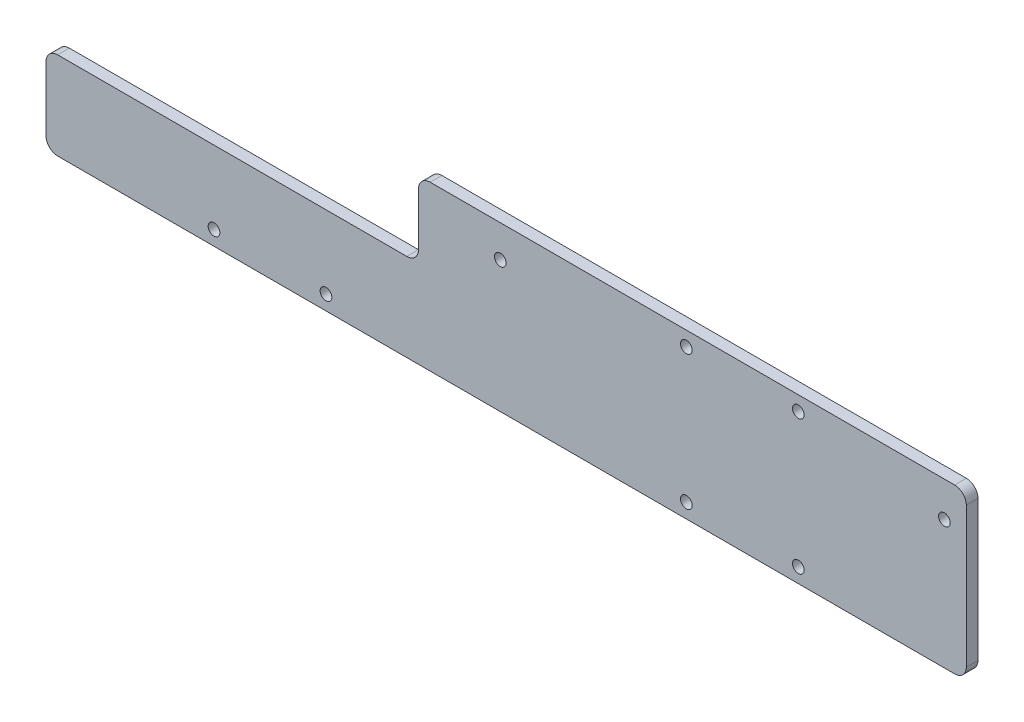
ISO-10303-21;
HEADER;
FILE_DESCRIPTION(('STEP AP214'),'2;1');
FILE_NAME('part.step','',(''),(''),'','','');
FILE_SCHEMA(('AUTOMOTIVE_DESIGN { 1 0 10303 214 1 1 1 1 }'));
ENDSEC;
DATA;
#1=APPLICATION_CONTEXT('core data for automotive mechanical design processes');
#2=APPLICATION_PROTOCOL_DEFINITION('international standard','automotive_design',2000,#1);
#3=PRODUCT_CONTEXT('',#1,'mechanical');
#4=PRODUCT('Part','Part','',(#3));
#5=PRODUCT_RELATED_PRODUCT_CATEGORY('part','',(#4));
#6=PRODUCT_DEFINITION_FORMATION('','',#4);
#7=PRODUCT_DEFINITION_CONTEXT('part definition',#1,'design');
#8=PRODUCT_DEFINITION('design','',#6,#7);
#9=PRODUCT_DEFINITION_SHAPE('','',#8);
#10=(LENGTH_UNIT() NAMED_UNIT(*) SI_UNIT(.MILLI.,.METRE.));
#11=(NAMED_UNIT(*) PLANE_ANGLE_UNIT() SI_UNIT($,.RADIAN.));
#12=(NAMED_UNIT(*) SI_UNIT($,.STERADIAN.) SOLID_ANGLE_UNIT());
#13=UNCERTAINTY_MEASURE_WITH_UNIT(LENGTH_MEASURE(1.E-05),#10,'distance_accuracy_value','');
#14=(GEOMETRIC_REPRESENTATION_CONTEXT(3) GLOBAL_UNCERTAINTY_ASSIGNED_CONTEXT((#13)) GLOBAL_UNIT_ASSIGNED_CONTEXT((#10,
#11,#12)) REPRESENTATION_CONTEXT('',''));
#15=CARTESIAN_POINT('',(0.,0.,0.));
#16=DIRECTION('',(0.,0.,1.));
#17=DIRECTION('',(1.,0.,0.));
#18=AXIS2_PLACEMENT_3D('',#15,#16,#17);
#19=CARTESIAN_POINT('',(0.,17.5899107385243,4.));
#20=DIRECTION('',(0.,-1.,0.));
#21=DIRECTION('',(1.,0.,0.));
#22=AXIS2_PLACEMENT_3D('',#19,#20,#21);
#23=PLANE('',#22);
#24=DIRECTION('',(0.,0.,-1.));
#25=VECTOR('',#24,1.);
#26=CARTESIAN_POINT('',(-61.1940627545055,17.5899107385243,4.));
#27=LINE('',#26,#25);
#28=CARTESIAN_POINT('',(-61.1940627545055,17.5899107385243,4.));
#29=VERTEX_POINT('',#28);
#30=CARTESIAN_POINT('',(-61.1940627545055,17.5899107385243,0.));
#31=VERTEX_POINT('',#30);
#32=EDGE_CURVE('E329',#29,#31,#27,.T.);
#33=ORIENTED_EDGE('',*,*,#32,.T.);
#34=DIRECTION('',(-1.,0.,0.));
#35=VECTOR('',#34,1.);
#36=CARTESIAN_POINT('',(0.,17.5899107385243,0.));
#37=LINE('',#36,#35);
#38=CARTESIAN_POINT('',(-180.694062754505,17.5899107385243,0.));
#39=VERTEX_POINT('',#38);
#40=EDGE_CURVE('E184',#31,#39,#37,.T.);
#41=ORIENTED_EDGE('',*,*,#40,.T.);
#42=DIRECTION('',(0.,0.,-1.));
#43=VECTOR('',#42,1.);
#44=CARTESIAN_POINT('',(-180.694062754505,17.5899107385243,4.));
#45=LINE('',#44,#43);
#46=CARTESIAN_POINT('',(-180.694062754505,17.5899107385243,4.));
#47=VERTEX_POINT('',#46);
#48=EDGE_CURVE('E11',#47,#39,#45,.T.);
#49=ORIENTED_EDGE('',*,*,#48,.F.);
#50=DIRECTION('',(-1.,0.,0.));
#51=VECTOR('',#50,1.);
#52=CARTESIAN_POINT('',(0.,17.5899107385243,4.));
#53=LINE('',#52,#51);
#54=EDGE_CURVE('E56',#29,#47,#53,.T.);
#55=ORIENTED_EDGE('',*,*,#54,.F.);
#56=EDGE_LOOP('',(#33,#41,#49,#55));
#57=FACE_BOUND('',#56,.T.);
#58=ADVANCED_FACE('F41',(#57),#23,.F.);
#59=CARTESIAN_POINT('',(-180.694062754505,13.5899107385243,4.));
#60=DIRECTION('',(0.,0.,-1.));
#61=DIRECTION('',(-1.,0.,0.));
#62=AXIS2_PLACEMENT_3D('',#59,#60,#61);
#63=CYLINDRICAL_SURFACE('',#62,4.);
#64=CARTESIAN_POINT('',(-180.694062754505,13.5899107385243,0.));
#65=DIRECTION('',(0.,0.,1.));
#66=DIRECTION('',(1.,0.,0.));
#67=AXIS2_PLACEMENT_3D('',#64,#65,#66);
#68=CIRCLE('',#67,4.);
#69=CARTESIAN_POINT('',(-184.694062754505,13.5899107385243,0.));
#70=VERTEX_POINT('',#69);
#71=EDGE_CURVE('E187',#70,#39,#68,.F.);
#72=ORIENTED_EDGE('',*,*,#71,.F.);
#73=DIRECTION('',(0.,0.,-1.));
#74=VECTOR('',#73,1.);
#75=CARTESIAN_POINT('',(-184.694062754505,13.5899107385243,4.));
#76=LINE('',#75,#74);
#77=CARTESIAN_POINT('',(-184.694062754505,13.5899107385243,4.));
#78=VERTEX_POINT('',#77);
#79=EDGE_CURVE('E49',#78,#70,#76,.T.);
#80=ORIENTED_EDGE('',*,*,#79,.F.);
#81=CARTESIAN_POINT('',(-180.694062754505,13.5899107385243,4.));
#82=DIRECTION('',(0.,0.,1.));
#83=DIRECTION('',(1.,0.,0.));
#84=AXIS2_PLACEMENT_3D('',#81,#82,#83);
#85=CIRCLE('',#84,4.);
#86=EDGE_CURVE('E277',#78,#47,#85,.F.);
#87=ORIENTED_EDGE('',*,*,#86,.T.);
#88=ORIENTED_EDGE('',*,*,#48,.T.);
#89=EDGE_LOOP('',(#72,#80,#87,#88));
#90=FACE_BOUND('',#89,.T.);
#91=ADVANCED_FACE('F265',(#90),#63,.T.);
#92=CARTESIAN_POINT('',(-184.694062754505,0.,4.));
#93=DIRECTION('',(-1.,0.,0.));
#94=DIRECTION('',(0.,0.,1.));
#95=AXIS2_PLACEMENT_3D('',#92,#93,#94);
#96=PLANE('',#95);
#97=DIRECTION('',(0.,1.,0.));
#98=VECTOR('',#97,1.);
#99=CARTESIAN_POINT('',(-184.694062754505,0.,0.));
#100=LINE('',#99,#98);
#101=CARTESIAN_POINT('',(-184.694062754505,-8.41008926147568,0.));
#102=VERTEX_POINT('',#101);
#103=EDGE_CURVE('E192',#102,#70,#100,.T.);
#104=ORIENTED_EDGE('',*,*,#103,.F.);
#105=DIRECTION('',(0.,0.,-1.));
#106=VECTOR('',#105,1.);
#107=CARTESIAN_POINT('',(-184.694062754505,-8.41008926147568,4.));
#108=LINE('',#107,#106);
#109=CARTESIAN_POINT('',(-184.694062754505,-8.41008926147568,4.));
#110=VERTEX_POINT('',#109);
#111=EDGE_CURVE('E253',#110,#102,#108,.T.);
#112=ORIENTED_EDGE('',*,*,#111,.F.);
#113=DIRECTION('',(0.,1.,0.));
#114=VECTOR('',#113,1.);
#115=CARTESIAN_POINT('',(-184.694062754505,0.,4.));
#116=LINE('',#115,#114);
#117=EDGE_CURVE('E262',#110,#78,#116,.T.);
#118=ORIENTED_EDGE('',*,*,#117,.T.);
#119=ORIENTED_EDGE('',*,*,#79,.T.);
#120=EDGE_LOOP('',(#104,#112,#118,#119));
#121=FACE_BOUND('',#120,.T.);
#122=ADVANCED_FACE('F260',(#121),#96,.T.);
#123=CARTESIAN_POINT('',(-180.694062754505,-8.41008926147568,4.));
#124=DIRECTION('',(0.,0.,-1.));
#125=DIRECTION('',(-1.,0.,0.));
#126=AXIS2_PLACEMENT_3D('',#123,#124,#125);
#127=CYLINDRICAL_SURFACE('',#126,4.);
#128=CARTESIAN_POINT('',(-180.694062754505,-8.41008926147568,0.));
#129=DIRECTION('',(0.,0.,1.));
#130=DIRECTION('',(1.,0.,0.));
#131=AXIS2_PLACEMENT_3D('',#128,#129,#130);
#132=CIRCLE('',#131,4.);
#133=CARTESIAN_POINT('',(-180.694062754505,-12.4100892614757,0.));
#134=VERTEX_POINT('',#133);
#135=EDGE_CURVE('E196',#134,#102,#132,.F.);
#136=ORIENTED_EDGE('',*,*,#135,.F.);
#137=DIRECTION('',(0.,0.,-1.));
#138=VECTOR('',#137,1.);
#139=CARTESIAN_POINT('',(-180.694062754505,-12.4100892614757,4.));
#140=LINE('',#139,#138);
#141=CARTESIAN_POINT('',(-180.694062754505,-12.4100892614757,4.));
#142=VERTEX_POINT('',#141);
#143=EDGE_CURVE('E250',#142,#134,#140,.T.);
#144=ORIENTED_EDGE('',*,*,#143,.F.);
#145=CARTESIAN_POINT('',(-180.694062754505,-8.41008926147568,4.));
#146=DIRECTION('',(0.,0.,1.));
#147=DIRECTION('',(1.,0.,0.));
#148=AXIS2_PLACEMENT_3D('',#145,#146,#147);
#149=CIRCLE('',#148,4.);
#150=EDGE_CURVE('E276',#142,#110,#149,.F.);
#151=ORIENTED_EDGE('',*,*,#150,.T.);
#152=ORIENTED_EDGE('',*,*,#111,.T.);
#153=EDGE_LOOP('',(#136,#144,#151,#152));
#154=FACE_BOUND('',#153,.T.);
#155=ADVANCED_FACE('F274',(#154),#127,.T.);
#156=CARTESIAN_POINT('',(0.,-12.4100892614757,4.));
#157=DIRECTION('',(0.,-1.,0.));
#158=DIRECTION('',(1.,0.,0.));
#159=AXIS2_PLACEMENT_3D('',#156,#157,#158);
#160=PLANE('',#159);
#161=DIRECTION('',(-1.,0.,0.));
#162=VECTOR('',#161,1.);
#163=CARTESIAN_POINT('',(0.,-12.4100892614757,0.));
#164=LINE('',#163,#162);
#165=CARTESIAN_POINT('',(126.305937245495,-12.4100892614757,0.));
#166=VERTEX_POINT('',#165);
#167=EDGE_CURVE('E200',#166,#134,#164,.T.);
#168=ORIENTED_EDGE('',*,*,#167,.F.);
#169=DIRECTION('',(0.,0.,-1.));
#170=VECTOR('',#169,1.);
#171=CARTESIAN_POINT('',(126.305937245495,-12.4100892614757,4.));
#172=LINE('',#171,#170);
#173=CARTESIAN_POINT('',(126.305937245495,-12.4100892614757,4.));
#174=VERTEX_POINT('',#173);
#175=EDGE_CURVE('E142',#174,#166,#172,.T.);
#176=ORIENTED_EDGE('',*,*,#175,.F.);
#177=DIRECTION('',(-1.,0.,0.));
#178=VECTOR('',#177,1.);
#179=CARTESIAN_POINT('',(0.,-12.4100892614757,4.));
#180=LINE('',#179,#178);
#181=EDGE_CURVE('E130',#174,#142,#180,.T.);
#182=ORIENTED_EDGE('',*,*,#181,.T.);
#183=ORIENTED_EDGE('',*,*,#143,.T.);
#184=EDGE_LOOP('',(#168,#176,#182,#183));
#185=FACE_BOUND('',#184,.T.);
#186=ADVANCED_FACE('F287',(#185),#160,.T.);
#187=CARTESIAN_POINT('',(126.305937245495,-8.41008926147565,4.));
#188=DIRECTION('',(0.,0.,-1.));
#189=DIRECTION('',(-1.,0.,0.));
#190=AXIS2_PLACEMENT_3D('',#187,#188,#189);
#191=CYLINDRICAL_SURFACE('',#190,4.);
#192=CARTESIAN_POINT('',(126.305937245495,-8.41008926147565,0.));
#193=DIRECTION('',(0.,0.,1.));
#194=DIRECTION('',(1.,0.,0.));
#195=AXIS2_PLACEMENT_3D('',#192,#193,#194);
#196=CIRCLE('',#195,4.);
#197=CARTESIAN_POINT('',(130.305937245495,-8.41008926147565,0.));
#198=VERTEX_POINT('',#197);
#199=EDGE_CURVE('E138',#166,#198,#196,.T.);
#200=ORIENTED_EDGE('',*,*,#199,.T.);
#201=DIRECTION('',(0.,0.,-1.));
#202=VECTOR('',#201,1.);
#203=CARTESIAN_POINT('',(130.305937245495,-8.41008926147565,4.));
#204=LINE('',#203,#202);
#205=CARTESIAN_POINT('',(130.305937245495,-8.41008926147565,4.));
#206=VERTEX_POINT('',#205);
#207=EDGE_CURVE('E135',#206,#198,#204,.T.);
#208=ORIENTED_EDGE('',*,*,#207,.F.);
#209=CARTESIAN_POINT('',(126.305937245495,-8.41008926147565,4.));
#210=DIRECTION('',(0.,0.,1.));
#211=DIRECTION('',(1.,0.,0.));
#212=AXIS2_PLACEMENT_3D('',#209,#210,#211);
#213=CIRCLE('',#212,4.);
#214=EDGE_CURVE('E121',#174,#206,#213,.T.);
#215=ORIENTED_EDGE('',*,*,#214,.F.);
#216=ORIENTED_EDGE('',*,*,#175,.T.);
#217=EDGE_LOOP('',(#200,#208,#215,#216));
#218=FACE_BOUND('',#217,.T.);
#219=ADVANCED_FACE('F136',(#218),#191,.T.);
#220=CARTESIAN_POINT('',(130.305937245495,0.,4.));
#221=DIRECTION('',(-1.,0.,0.));
#222=DIRECTION('',(0.,0.,1.));
#223=AXIS2_PLACEMENT_3D('',#220,#221,#222);
#224=PLANE('',#223);
#225=DIRECTION('',(0.,1.,0.));
#226=VECTOR('',#225,1.);
#227=CARTESIAN_POINT('',(130.305937245495,0.,0.));
#228=LINE('',#227,#226);
#229=CARTESIAN_POINT('',(130.305937245495,39.5899107385243,0.));
#230=VERTEX_POINT('',#229);
#231=EDGE_CURVE('E206',#198,#230,#228,.T.);
#232=ORIENTED_EDGE('',*,*,#231,.T.);
#233=DIRECTION('',(0.,0.,-1.));
#234=VECTOR('',#233,1.);
#235=CARTESIAN_POINT('',(130.305937245495,39.5899107385243,4.));
#236=LINE('',#235,#234);
#237=CARTESIAN_POINT('',(130.305937245495,39.5899107385243,4.));
#238=VERTEX_POINT('',#237);
#239=EDGE_CURVE('E143',#238,#230,#236,.T.);
#240=ORIENTED_EDGE('',*,*,#239,.F.);
#241=DIRECTION('',(0.,1.,0.));
#242=VECTOR('',#241,1.);
#243=CARTESIAN_POINT('',(130.305937245495,0.,4.));
#244=LINE('',#243,#242);
#245=EDGE_CURVE('E126',#206,#238,#244,.T.);
#246=ORIENTED_EDGE('',*,*,#245,.F.);
#247=ORIENTED_EDGE('',*,*,#207,.T.);
#248=EDGE_LOOP('',(#232,#240,#246,#247));
#249=FACE_BOUND('',#248,.T.);
#250=ADVANCED_FACE('F145',(#249),#224,.F.);
#251=CARTESIAN_POINT('',(126.305937245495,39.5899107385243,4.));
#252=DIRECTION('',(0.,0.,-1.));
#253=DIRECTION('',(-1.,0.,0.));
#254=AXIS2_PLACEMENT_3D('',#251,#252,#253);
#255=CYLINDRICAL_SURFACE('',#254,4.);
#256=CARTESIAN_POINT('',(126.305937245495,39.5899107385243,0.));
#257=DIRECTION('',(0.,0.,1.));
#258=DIRECTION('',(1.,0.,0.));
#259=AXIS2_PLACEMENT_3D('',#256,#257,#258);
#260=CIRCLE('',#259,4.);
#261=CARTESIAN_POINT('',(126.305937245495,43.5899107385243,0.));
#262=VERTEX_POINT('',#261);
#263=EDGE_CURVE('E209',#230,#262,#260,.T.);
#264=ORIENTED_EDGE('',*,*,#263,.T.);
#265=DIRECTION('',(0.,0.,-1.));
#266=VECTOR('',#265,1.);
#267=CARTESIAN_POINT('',(126.305937245495,43.5899107385243,4.));
#268=LINE('',#267,#266);
#269=CARTESIAN_POINT('',(126.305937245495,43.5899107385243,4.));
#270=VERTEX_POINT('',#269);
#271=EDGE_CURVE('E98',#270,#262,#268,.T.);
#272=ORIENTED_EDGE('',*,*,#271,.F.);
#273=CARTESIAN_POINT('',(126.305937245495,39.5899107385243,4.));
#274=DIRECTION('',(0.,0.,1.));
#275=DIRECTION('',(1.,0.,0.));
#276=AXIS2_PLACEMENT_3D('',#273,#274,#275);
#277=CIRCLE('',#276,4.);
#278=EDGE_CURVE('E65',#238,#270,#277,.T.);
#279=ORIENTED_EDGE('',*,*,#278,.F.);
#280=ORIENTED_EDGE('',*,*,#239,.T.);
#281=EDGE_LOOP('',(#264,#272,#279,#280));
#282=FACE_BOUND('',#281,.T.);
#283=ADVANCED_FACE('F290',(#282),#255,.T.);
#284=CARTESIAN_POINT('',(0.,43.5899107385243,4.));
#285=DIRECTION('',(0.,1.,0.));
#286=DIRECTION('',(-1.,0.,0.));
#287=AXIS2_PLACEMENT_3D('',#284,#285,#286);
#288=PLANE('',#287);
#289=DIRECTION('',(1.,0.,0.));
#290=VECTOR('',#289,1.);
#291=CARTESIAN_POINT('',(0.,43.5899107385243,0.));
#292=LINE('',#291,#290);
#293=CARTESIAN_POINT('',(-53.1940627545055,43.5899107385243,0.));
#294=VERTEX_POINT('',#293);
#295=EDGE_CURVE('E212',#294,#262,#292,.T.);
#296=ORIENTED_EDGE('',*,*,#295,.F.);
#297=DIRECTION('',(0.,0.,-1.));
#298=VECTOR('',#297,1.);
#299=CARTESIAN_POINT('',(-53.1940627545055,43.5899107385243,4.));
#300=LINE('',#299,#298);
#301=CARTESIAN_POINT('',(-53.1940627545055,43.5899107385243,4.));
#302=VERTEX_POINT('',#301);
#303=EDGE_CURVE('E188',#302,#294,#300,.T.);
#304=ORIENTED_EDGE('',*,*,#303,.F.);
#305=DIRECTION('',(1.,0.,0.));
#306=VECTOR('',#305,1.);
#307=CARTESIAN_POINT('',(0.,43.5899107385243,4.));
#308=LINE('',#307,#306);
#309=EDGE_CURVE('E150',#302,#270,#308,.T.);
#310=ORIENTED_EDGE('',*,*,#309,.T.);
#311=ORIENTED_EDGE('',*,*,#271,.T.);
#312=EDGE_LOOP('',(#296,#304,#310,#311));
#313=FACE_BOUND('',#312,.T.);
#314=ADVANCED_FACE('F292',(#313),#288,.T.);
#315=CARTESIAN_POINT('',(-127.194062754505,-7.41008926147568,4.));
#316=DIRECTION('',(0.,0.,-1.));
#317=DIRECTION('',(-1.,0.,0.));
#318=AXIS2_PLACEMENT_3D('',#315,#316,#317);
#319=CYLINDRICAL_SURFACE('',#318,2.);
#320=CARTESIAN_POINT('',(-127.194062754505,-7.41008926147568,4.));
#321=DIRECTION('',(0.,0.,1.));
#322=DIRECTION('',(1.,0.,0.));
#323=AXIS2_PLACEMENT_3D('',#320,#321,#322);
#324=CIRCLE('',#323,2.);
#325=CARTESIAN_POINT('',(-125.194062754505,-7.41008926147568,4.));
#326=VERTEX_POINT('',#325);
#327=EDGE_CURVE('E176',#326,#326,#324,.T.);
#328=ORIENTED_EDGE('',*,*,#327,.T.);
#329=EDGE_LOOP('',(#328));
#330=FACE_BOUND('',#329,.T.);
#331=CARTESIAN_POINT('',(-127.194062754505,-7.41008926147568,0.));
#332=DIRECTION('',(0.,0.,1.));
#333=DIRECTION('',(1.,0.,0.));
#334=AXIS2_PLACEMENT_3D('',#331,#332,#333);
#335=CIRCLE('',#334,2.);
#336=CARTESIAN_POINT('',(-125.194062754505,-7.41008926147568,0.));
#337=VERTEX_POINT('',#336);
#338=EDGE_CURVE('E236',#337,#337,#335,.T.);
#339=ORIENTED_EDGE('',*,*,#338,.F.);
#340=EDGE_LOOP('',(#339));
#341=FACE_BOUND('',#340,.T.);
#342=ADVANCED_FACE('F388',(#330,#341),#319,.F.);
#343=CARTESIAN_POINT('',(-88.8640627545055,-7.41008926147558,4.));
#344=DIRECTION('',(0.,0.,-1.));
#345=DIRECTION('',(-1.,0.,0.));
#346=AXIS2_PLACEMENT_3D('',#343,#344,#345);
#347=CYLINDRICAL_SURFACE('',#346,2.);
#348=CARTESIAN_POINT('',(-88.8640627545055,-7.41008926147558,4.));
#349=DIRECTION('',(0.,0.,1.));
#350=DIRECTION('',(1.,0.,0.));
#351=AXIS2_PLACEMENT_3D('',#348,#349,#350);
#352=CIRCLE('',#351,2.);
#353=CARTESIAN_POINT('',(-86.8640627545055,-7.41008926147558,4.));
#354=VERTEX_POINT('',#353);
#355=EDGE_CURVE('E172',#354,#354,#352,.T.);
#356=ORIENTED_EDGE('',*,*,#355,.T.);
#357=EDGE_LOOP('',(#356));
#358=FACE_BOUND('',#357,.T.);
#359=CARTESIAN_POINT('',(-88.8640627545055,-7.41008926147558,0.));
#360=DIRECTION('',(0.,0.,1.));
#361=DIRECTION('',(1.,0.,0.));
#362=AXIS2_PLACEMENT_3D('',#359,#360,#361);
#363=CIRCLE('',#362,2.);
#364=CARTESIAN_POINT('',(-86.8640627545055,-7.41008926147558,0.));
#365=VERTEX_POINT('',#364);
#366=EDGE_CURVE('E232',#365,#365,#363,.T.);
#367=ORIENTED_EDGE('',*,*,#366,.F.);
#368=EDGE_LOOP('',(#367));
#369=FACE_BOUND('',#368,.T.);
#370=ADVANCED_FACE('F405',(#358,#369),#347,.F.);
#371=CARTESIAN_POINT('',(34.4759372454946,-7.41008926147557,4.));
#372=DIRECTION('',(0.,0.,-1.));
#373=DIRECTION('',(-1.,0.,0.));
#374=AXIS2_PLACEMENT_3D('',#371,#372,#373);
#375=CYLINDRICAL_SURFACE('',#374,2.);
#376=CARTESIAN_POINT('',(34.4759372454946,-7.41008926147557,4.));
#377=DIRECTION('',(0.,0.,1.));
#378=DIRECTION('',(1.,0.,0.));
#379=AXIS2_PLACEMENT_3D('',#376,#377,#378);
#380=CIRCLE('',#379,2.);
#381=CARTESIAN_POINT('',(36.4759372454946,-7.41008926147557,4.));
#382=VERTEX_POINT('',#381);
#383=EDGE_CURVE('E168',#382,#382,#380,.F.);
#384=ORIENTED_EDGE('',*,*,#383,.F.);
#385=EDGE_LOOP('',(#384));
#386=FACE_BOUND('',#385,.T.);
#387=CARTESIAN_POINT('',(34.4759372454946,-7.41008926147557,0.));
#388=DIRECTION('',(0.,0.,1.));
#389=DIRECTION('',(1.,0.,0.));
#390=AXIS2_PLACEMENT_3D('',#387,#388,#389);
#391=CIRCLE('',#390,2.);
#392=CARTESIAN_POINT('',(36.4759372454946,-7.41008926147557,0.));
#393=VERTEX_POINT('',#392);
#394=EDGE_CURVE('E228',#393,#393,#391,.F.);
#395=ORIENTED_EDGE('',*,*,#394,.T.);
#396=EDGE_LOOP('',(#395));
#397=FACE_BOUND('',#396,.T.);
#398=ADVANCED_FACE('F401',(#386,#397),#375,.F.);
#399=CARTESIAN_POINT('',(34.4759372454945,38.5899107385244,4.));
#400=DIRECTION('',(0.,0.,-1.));
#401=DIRECTION('',(-1.,0.,0.));
#402=AXIS2_PLACEMENT_3D('',#399,#400,#401);
#403=CYLINDRICAL_SURFACE('',#402,1.99999999999999);
#404=CARTESIAN_POINT('',(34.4759372454945,38.5899107385244,4.));
#405=DIRECTION('',(0.,0.,1.));
#406=DIRECTION('',(1.,0.,0.));
#407=AXIS2_PLACEMENT_3D('',#404,#405,#406);
#408=CIRCLE('',#407,1.99999999999999);
#409=CARTESIAN_POINT('',(36.4759372454945,38.5899107385244,4.));
#410=VERTEX_POINT('',#409);
#411=EDGE_CURVE('E164',#410,#410,#408,.T.);
#412=ORIENTED_EDGE('',*,*,#411,.T.);
#413=EDGE_LOOP('',(#412));
#414=FACE_BOUND('',#413,.T.);
#415=CARTESIAN_POINT('',(34.4759372454945,38.5899107385244,0.));
#416=DIRECTION('',(0.,0.,1.));
#417=DIRECTION('',(1.,0.,0.));
#418=AXIS2_PLACEMENT_3D('',#415,#416,#417);
#419=CIRCLE('',#418,1.99999999999999);
#420=CARTESIAN_POINT('',(36.4759372454945,38.5899107385244,0.));
#421=VERTEX_POINT('',#420);
#422=EDGE_CURVE('E224',#421,#421,#419,.T.);
#423=ORIENTED_EDGE('',*,*,#422,.F.);
#424=EDGE_LOOP('',(#423));
#425=FACE_BOUND('',#424,.T.);
#426=ADVANCED_FACE('F397',(#414,#425),#403,.F.);
#427=CARTESIAN_POINT('',(72.8059372454945,38.5899107385243,4.));
#428=DIRECTION('',(0.,0.,-1.));
#429=DIRECTION('',(-1.,0.,0.));
#430=AXIS2_PLACEMENT_3D('',#427,#428,#429);
#431=CYLINDRICAL_SURFACE('',#430,2.);
#432=CARTESIAN_POINT('',(72.8059372454945,38.5899107385243,4.));
#433=DIRECTION('',(0.,0.,1.));
#434=DIRECTION('',(1.,0.,0.));
#435=AXIS2_PLACEMENT_3D('',#432,#433,#434);
#436=CIRCLE('',#435,2.);
#437=CARTESIAN_POINT('',(74.8059372454945,38.5899107385243,4.));
#438=VERTEX_POINT('',#437);
#439=EDGE_CURVE('E160',#438,#438,#436,.T.);
#440=ORIENTED_EDGE('',*,*,#439,.T.);
#441=EDGE_LOOP('',(#440));
#442=FACE_BOUND('',#441,.T.);
#443=CARTESIAN_POINT('',(72.8059372454945,38.5899107385243,0.));
#444=DIRECTION('',(0.,0.,1.));
#445=DIRECTION('',(1.,0.,0.));
#446=AXIS2_PLACEMENT_3D('',#443,#444,#445);
#447=CIRCLE('',#446,2.);
#448=CARTESIAN_POINT('',(74.8059372454945,38.5899107385243,0.));
#449=VERTEX_POINT('',#448);
#450=EDGE_CURVE('E220',#449,#449,#447,.T.);
#451=ORIENTED_EDGE('',*,*,#450,.F.);
#452=EDGE_LOOP('',(#451));
#453=FACE_BOUND('',#452,.T.);
#454=ADVANCED_FACE('F393',(#442,#453),#431,.F.);
#455=CARTESIAN_POINT('',(122.805937245495,31.5899107385243,4.));
#456=DIRECTION('',(0.,0.,-1.));
#457=DIRECTION('',(-1.,0.,0.));
#458=AXIS2_PLACEMENT_3D('',#455,#456,#457);
#459=CYLINDRICAL_SURFACE('',#458,2.);
#460=CARTESIAN_POINT('',(122.805937245495,31.5899107385243,4.));
#461=DIRECTION('',(0.,0.,1.));
#462=DIRECTION('',(1.,0.,0.));
#463=AXIS2_PLACEMENT_3D('',#460,#461,#462);
#464=CIRCLE('',#463,2.);
#465=CARTESIAN_POINT('',(124.805937245495,31.5899107385243,4.));
#466=VERTEX_POINT('',#465);
#467=EDGE_CURVE('E156',#466,#466,#464,.T.);
#468=ORIENTED_EDGE('',*,*,#467,.T.);
#469=EDGE_LOOP('',(#468));
#470=FACE_BOUND('',#469,.T.);
#471=CARTESIAN_POINT('',(122.805937245495,31.5899107385243,0.));
#472=DIRECTION('',(0.,0.,1.));
#473=DIRECTION('',(1.,0.,0.));
#474=AXIS2_PLACEMENT_3D('',#471,#472,#473);
#475=CIRCLE('',#474,2.);
#476=CARTESIAN_POINT('',(124.805937245495,31.5899107385243,0.));
#477=VERTEX_POINT('',#476);
#478=EDGE_CURVE('E216',#477,#477,#475,.T.);
#479=ORIENTED_EDGE('',*,*,#478,.F.);
#480=EDGE_LOOP('',(#479));
#481=FACE_BOUND('',#480,.T.);
#482=ADVANCED_FACE('F389',(#470,#481),#459,.F.);
#483=CARTESIAN_POINT('',(72.8059372454946,-7.41008926147566,4.));
#484=DIRECTION('',(0.,0.,-1.));
#485=DIRECTION('',(-1.,0.,0.));
#486=AXIS2_PLACEMENT_3D('',#483,#484,#485);
#487=CYLINDRICAL_SURFACE('',#486,2.00000000000001);
#488=CARTESIAN_POINT('',(72.8059372454946,-7.41008926147566,4.));
#489=DIRECTION('',(0.,0.,1.));
#490=DIRECTION('',(1.,0.,0.));
#491=AXIS2_PLACEMENT_3D('',#488,#489,#490);
#492=CIRCLE('',#491,2.00000000000001);
#493=CARTESIAN_POINT('',(74.8059372454946,-7.41008926147566,4.));
#494=VERTEX_POINT('',#493);
#495=EDGE_CURVE('E180',#494,#494,#492,.F.);
#496=ORIENTED_EDGE('',*,*,#495,.F.);
#497=EDGE_LOOP('',(#496));
#498=FACE_BOUND('',#497,.T.);
#499=CARTESIAN_POINT('',(72.8059372454946,-7.41008926147566,0.));
#500=DIRECTION('',(0.,0.,1.));
#501=DIRECTION('',(1.,0.,0.));
#502=AXIS2_PLACEMENT_3D('',#499,#500,#501);
#503=CIRCLE('',#502,2.00000000000001);
#504=CARTESIAN_POINT('',(74.8059372454946,-7.41008926147566,0.));
#505=VERTEX_POINT('',#504);
#506=EDGE_CURVE('E240',#505,#505,#503,.F.);
#507=ORIENTED_EDGE('',*,*,#506,.T.);
#508=EDGE_LOOP('',(#507));
#509=FACE_BOUND('',#508,.T.);
#510=ADVANCED_FACE('F392',(#498,#509),#487,.F.);
#511=CARTESIAN_POINT('',(0.,0.,4.));
#512=DIRECTION('',(0.,0.,1.));
#513=DIRECTION('',(1.,0.,0.));
#514=AXIS2_PLACEMENT_3D('',#511,#512,#513);
#515=PLANE('',#514);
#516=CARTESIAN_POINT('',(-29.1940627545055,32.5899107385243,4.));
#517=DIRECTION('',(0.,0.,1.));
#518=DIRECTION('',(1.,0.,0.));
#519=AXIS2_PLACEMENT_3D('',#516,#517,#518);
#520=CIRCLE('',#519,2.00000000000001);
#521=CARTESIAN_POINT('',(-27.1940627545055,32.5899107385243,4.));
#522=VERTEX_POINT('',#521);
#523=EDGE_CURVE('E338',#522,#522,#520,.T.);
#524=ORIENTED_EDGE('',*,*,#523,.F.);
#525=EDGE_LOOP('',(#524));
#526=FACE_BOUND('',#525,.T.);
#527=ORIENTED_EDGE('',*,*,#309,.F.);
#528=CARTESIAN_POINT('',(-53.1940627545055,39.5899107385243,4.));
#529=DIRECTION('',(0.,0.,-1.));
#530=DIRECTION('',(-1.,0.,0.));
#531=AXIS2_PLACEMENT_3D('',#528,#529,#530);
#532=CIRCLE('',#531,4.);
#533=CARTESIAN_POINT('',(-57.1940627545055,39.5899107385243,4.));
#534=VERTEX_POINT('',#533);
#535=EDGE_CURVE('E298',#534,#302,#532,.T.);
#536=ORIENTED_EDGE('',*,*,#535,.F.);
#537=DIRECTION('',(0.,-1.,0.));
#538=VECTOR('',#537,1.);
#539=CARTESIAN_POINT('',(-57.1940627545055,0.,4.));
#540=LINE('',#539,#538);
#541=CARTESIAN_POINT('',(-57.1940627545055,21.5899107385243,4.));
#542=VERTEX_POINT('',#541);
#543=EDGE_CURVE('E316',#534,#542,#540,.T.);
#544=ORIENTED_EDGE('',*,*,#543,.T.);
#545=CARTESIAN_POINT('',(-61.1940627545055,21.5899107385243,4.));
#546=DIRECTION('',(0.,0.,-1.));
#547=DIRECTION('',(-1.,0.,0.));
#548=AXIS2_PLACEMENT_3D('',#545,#546,#547);
#549=CIRCLE('',#548,4.00000000000001);
#550=EDGE_CURVE('E319',#29,#542,#549,.F.);
#551=ORIENTED_EDGE('',*,*,#550,.F.);
#552=ORIENTED_EDGE('',*,*,#54,.T.);
#553=ORIENTED_EDGE('',*,*,#86,.F.);
#554=ORIENTED_EDGE('',*,*,#117,.F.);
#555=ORIENTED_EDGE('',*,*,#150,.F.);
#556=ORIENTED_EDGE('',*,*,#181,.F.);
#557=ORIENTED_EDGE('',*,*,#214,.T.);
#558=ORIENTED_EDGE('',*,*,#245,.T.);
#559=ORIENTED_EDGE('',*,*,#278,.T.);
#560=EDGE_LOOP('',(#527,#536,#544,#551,#552,#553,#554,#555,#556,#557,#558,#559));
#561=FACE_BOUND('',#560,.T.);
#562=ORIENTED_EDGE('',*,*,#467,.F.);
#563=EDGE_LOOP('',(#562));
#564=FACE_BOUND('',#563,.T.);
#565=ORIENTED_EDGE('',*,*,#439,.F.);
#566=EDGE_LOOP('',(#565));
#567=FACE_BOUND('',#566,.T.);
#568=ORIENTED_EDGE('',*,*,#411,.F.);
#569=EDGE_LOOP('',(#568));
#570=FACE_BOUND('',#569,.T.);
#571=ORIENTED_EDGE('',*,*,#383,.T.);
#572=EDGE_LOOP('',(#571));
#573=FACE_BOUND('',#572,.T.);
#574=ORIENTED_EDGE('',*,*,#355,.F.);
#575=EDGE_LOOP('',(#574));
#576=FACE_BOUND('',#575,.T.);
#577=ORIENTED_EDGE('',*,*,#327,.F.);
#578=EDGE_LOOP('',(#577));
#579=FACE_BOUND('',#578,.T.);
#580=ORIENTED_EDGE('',*,*,#495,.T.);
#581=EDGE_LOOP('',(#580));
#582=FACE_BOUND('',#581,.T.);
#583=ADVANCED_FACE('F123',(#526,#561,#564,#567,#570,#573,#576,#579,#582),#515,.T.);
#584=CARTESIAN_POINT('',(0.,0.,0.));
#585=DIRECTION('',(0.,0.,1.));
#586=DIRECTION('',(1.,0.,0.));
#587=AXIS2_PLACEMENT_3D('',#584,#585,#586);
#588=PLANE('',#587);
#589=CARTESIAN_POINT('',(-29.1940627545055,32.5899107385243,0.));
#590=DIRECTION('',(0.,0.,-1.));
#591=DIRECTION('',(-1.,0.,0.));
#592=AXIS2_PLACEMENT_3D('',#589,#590,#591);
#593=CIRCLE('',#592,2.00000000000001);
#594=CARTESIAN_POINT('',(-31.1940627545055,32.5899107385243,0.));
#595=VERTEX_POINT('',#594);
#596=EDGE_CURVE('E432',#595,#595,#593,.T.);
#597=ORIENTED_EDGE('',*,*,#596,.F.);
#598=EDGE_LOOP('',(#597));
#599=FACE_BOUND('',#598,.T.);
#600=CARTESIAN_POINT('',(-53.1940627545055,39.5899107385243,0.));
#601=DIRECTION('',(0.,0.,-1.));
#602=DIRECTION('',(-1.,0.,0.));
#603=AXIS2_PLACEMENT_3D('',#600,#601,#602);
#604=CIRCLE('',#603,4.);
#605=CARTESIAN_POINT('',(-57.1940627545055,39.5899107385243,0.));
#606=VERTEX_POINT('',#605);
#607=EDGE_CURVE('E333',#606,#294,#604,.T.);
#608=ORIENTED_EDGE('',*,*,#607,.T.);
#609=ORIENTED_EDGE('',*,*,#295,.T.);
#610=ORIENTED_EDGE('',*,*,#263,.F.);
#611=ORIENTED_EDGE('',*,*,#231,.F.);
#612=ORIENTED_EDGE('',*,*,#199,.F.);
#613=ORIENTED_EDGE('',*,*,#167,.T.);
#614=ORIENTED_EDGE('',*,*,#135,.T.);
#615=ORIENTED_EDGE('',*,*,#103,.T.);
#616=ORIENTED_EDGE('',*,*,#71,.T.);
#617=ORIENTED_EDGE('',*,*,#40,.F.);
#618=CARTESIAN_POINT('',(-61.1940627545055,21.5899107385243,0.));
#619=DIRECTION('',(0.,0.,-1.));
#620=DIRECTION('',(-1.,0.,0.));
#621=AXIS2_PLACEMENT_3D('',#618,#619,#620);
#622=CIRCLE('',#621,4.00000000000001);
#623=CARTESIAN_POINT('',(-57.1940627545055,21.5899107385243,0.));
#624=VERTEX_POINT('',#623);
#625=EDGE_CURVE('E343',#31,#624,#622,.F.);
#626=ORIENTED_EDGE('',*,*,#625,.T.);
#627=DIRECTION('',(0.,-1.,0.));
#628=VECTOR('',#627,1.);
#629=CARTESIAN_POINT('',(-57.1940627545055,0.,0.));
#630=LINE('',#629,#628);
#631=EDGE_CURVE('E324',#606,#624,#630,.T.);
#632=ORIENTED_EDGE('',*,*,#631,.F.);
#633=EDGE_LOOP('',(#608,#609,#610,#611,#612,#613,#614,#615,#616,#617,#626,#632));
#634=FACE_BOUND('',#633,.T.);
#635=ORIENTED_EDGE('',*,*,#506,.F.);
#636=EDGE_LOOP('',(#635));
#637=FACE_BOUND('',#636,.T.);
#638=ORIENTED_EDGE('',*,*,#338,.T.);
#639=EDGE_LOOP('',(#638));
#640=FACE_BOUND('',#639,.T.);
#641=ORIENTED_EDGE('',*,*,#366,.T.);
#642=EDGE_LOOP('',(#641));
#643=FACE_BOUND('',#642,.T.);
#644=ORIENTED_EDGE('',*,*,#394,.F.);
#645=EDGE_LOOP('',(#644));
#646=FACE_BOUND('',#645,.T.);
#647=ORIENTED_EDGE('',*,*,#422,.T.);
#648=EDGE_LOOP('',(#647));
#649=FACE_BOUND('',#648,.T.);
#650=ORIENTED_EDGE('',*,*,#450,.T.);
#651=EDGE_LOOP('',(#650));
#652=FACE_BOUND('',#651,.T.);
#653=ORIENTED_EDGE('',*,*,#478,.T.);
#654=EDGE_LOOP('',(#653));
#655=FACE_BOUND('',#654,.T.);
#656=ADVANCED_FACE('F269',(#599,#634,#637,#640,#643,#646,#649,#652,#655),#588,.F.);
#657=CARTESIAN_POINT('',(-53.1940627545055,39.5899107385243,4.));
#658=DIRECTION('',(0.,0.,-1.));
#659=DIRECTION('',(-1.,0.,0.));
#660=AXIS2_PLACEMENT_3D('',#657,#658,#659);
#661=CYLINDRICAL_SURFACE('',#660,4.);
#662=ORIENTED_EDGE('',*,*,#607,.F.);
#663=DIRECTION('',(0.,0.,-1.));
#664=VECTOR('',#663,1.);
#665=CARTESIAN_POINT('',(-57.1940627545055,39.5899107385243,4.));
#666=LINE('',#665,#664);
#667=EDGE_CURVE('E314',#534,#606,#666,.T.);
#668=ORIENTED_EDGE('',*,*,#667,.F.);
#669=ORIENTED_EDGE('',*,*,#535,.T.);
#670=ORIENTED_EDGE('',*,*,#303,.T.);
#671=EDGE_LOOP('',(#662,#668,#669,#670));
#672=FACE_BOUND('',#671,.T.);
#673=ADVANCED_FACE('F356',(#672),#661,.T.);
#674=CARTESIAN_POINT('',(-57.1940627545055,0.,4.));
#675=DIRECTION('',(1.,0.,0.));
#676=DIRECTION('',(0.,1.,0.));
#677=AXIS2_PLACEMENT_3D('',#674,#675,#676);
#678=PLANE('',#677);
#679=ORIENTED_EDGE('',*,*,#631,.T.);
#680=DIRECTION('',(0.,0.,-1.));
#681=VECTOR('',#680,1.);
#682=CARTESIAN_POINT('',(-57.1940627545055,21.5899107385243,4.));
#683=LINE('',#682,#681);
#684=EDGE_CURVE('E322',#542,#624,#683,.T.);
#685=ORIENTED_EDGE('',*,*,#684,.F.);
#686=ORIENTED_EDGE('',*,*,#543,.F.);
#687=ORIENTED_EDGE('',*,*,#667,.T.);
#688=EDGE_LOOP('',(#679,#685,#686,#687));
#689=FACE_BOUND('',#688,.T.);
#690=ADVANCED_FACE('F323',(#689),#678,.F.);
#691=CARTESIAN_POINT('',(-61.1940627545055,21.5899107385243,4.));
#692=DIRECTION('',(0.,0.,-1.));
#693=DIRECTION('',(-1.,0.,0.));
#694=AXIS2_PLACEMENT_3D('',#691,#692,#693);
#695=CYLINDRICAL_SURFACE('',#694,4.00000000000001);
#696=ORIENTED_EDGE('',*,*,#625,.F.);
#697=ORIENTED_EDGE('',*,*,#32,.F.);
#698=ORIENTED_EDGE('',*,*,#550,.T.);
#699=ORIENTED_EDGE('',*,*,#684,.T.);
#700=EDGE_LOOP('',(#696,#697,#698,#699));
#701=FACE_BOUND('',#700,.T.);
#702=ADVANCED_FACE('F331',(#701),#695,.F.);
#703=CARTESIAN_POINT('',(-29.1940627545055,32.5899107385243,10.));
#704=DIRECTION('',(0.,0.,-1.));
#705=DIRECTION('',(-1.,0.,0.));
#706=AXIS2_PLACEMENT_3D('',#703,#704,#705);
#707=CYLINDRICAL_SURFACE('',#706,2.00000000000001);
#708=ORIENTED_EDGE('',*,*,#523,.T.);
#709=EDGE_LOOP('',(#708));
#710=FACE_BOUND('',#709,.T.);
#711=ORIENTED_EDGE('',*,*,#596,.T.);
#712=EDGE_LOOP('',(#711));
#713=FACE_BOUND('',#712,.T.);
#714=ADVANCED_FACE('F420',(#710,#713),#707,.F.);
#715=CLOSED_SHELL('',(#58,#91,#122,#155,#186,#219,#250,#283,#314,#342,#370,#398,#426,#454,#482,
#510,#583,#656,#673,#690,#702,#714));
#716=MANIFOLD_SOLID_BREP('B2',#715);
#717=ADVANCED_BREP_SHAPE_REPRESENTATION('',(#18,#716),#14);
#718=SHAPE_DEFINITION_REPRESENTATION(#9,#717);
ENDSEC;
END-ISO-10303-21;
